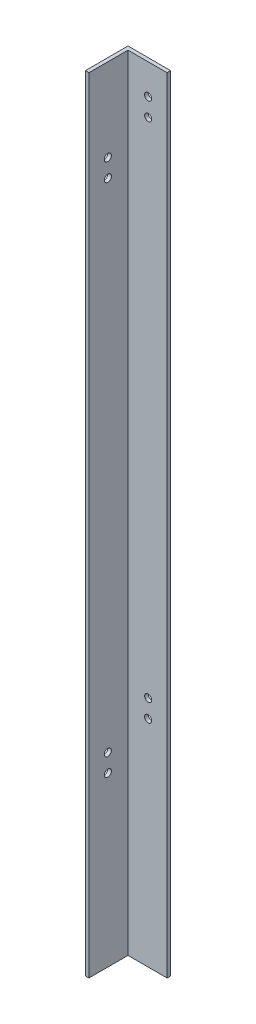
ISO-10303-21;
HEADER;
FILE_DESCRIPTION(('STEP AP214'),'2;1');
FILE_NAME('part.step','',(''),(''),'','','');
FILE_SCHEMA(('AUTOMOTIVE_DESIGN { 1 0 10303 214 1 1 1 1 }'));
ENDSEC;
DATA;
#1=APPLICATION_CONTEXT('core data for automotive mechanical design processes');
#2=APPLICATION_PROTOCOL_DEFINITION('international standard','automotive_design',2000,#1);
#3=PRODUCT_CONTEXT('',#1,'mechanical');
#4=PRODUCT('Part','Part','',(#3));
#5=PRODUCT_RELATED_PRODUCT_CATEGORY('part','',(#4));
#6=PRODUCT_DEFINITION_FORMATION('','',#4);
#7=PRODUCT_DEFINITION_CONTEXT('part definition',#1,'design');
#8=PRODUCT_DEFINITION('design','',#6,#7);
#9=PRODUCT_DEFINITION_SHAPE('','',#8);
#10=(LENGTH_UNIT() NAMED_UNIT(*) SI_UNIT(.MILLI.,.METRE.));
#11=(NAMED_UNIT(*) PLANE_ANGLE_UNIT() SI_UNIT($,.RADIAN.));
#12=(NAMED_UNIT(*) SI_UNIT($,.STERADIAN.) SOLID_ANGLE_UNIT());
#13=UNCERTAINTY_MEASURE_WITH_UNIT(LENGTH_MEASURE(1.E-05),#10,'distance_accuracy_value','');
#14=(GEOMETRIC_REPRESENTATION_CONTEXT(3) GLOBAL_UNCERTAINTY_ASSIGNED_CONTEXT((#13)) GLOBAL_UNIT_ASSIGNED_CONTEXT((#10,
#11,#12)) REPRESENTATION_CONTEXT('',''));
#15=CARTESIAN_POINT('',(0.,0.,0.));
#16=DIRECTION('',(0.,0.,1.));
#17=DIRECTION('',(1.,0.,0.));
#18=AXIS2_PLACEMENT_3D('',#15,#16,#17);
#19=CARTESIAN_POINT('',(-38.0999999999999,0.,3.2));
#20=DIRECTION('',(0.,1.,0.));
#21=DIRECTION('',(0.,0.,1.));
#22=AXIS2_PLACEMENT_3D('',#19,#20,#21);
#23=PLANE('',#22);
#24=DIRECTION('',(1.,0.,0.));
#25=VECTOR('',#24,1.);
#26=CARTESIAN_POINT('',(-38.0999999999999,0.,0.));
#27=LINE('',#26,#25);
#28=CARTESIAN_POINT('',(-38.0999999999999,0.,0.));
#29=VERTEX_POINT('',#28);
#30=CARTESIAN_POINT('',(0.,0.,0.));
#31=VERTEX_POINT('',#30);
#32=EDGE_CURVE('E97',#29,#31,#27,.T.);
#33=ORIENTED_EDGE('',*,*,#32,.T.);
#34=DIRECTION('',(0.,0.,-1.));
#35=VECTOR('',#34,1.);
#36=CARTESIAN_POINT('',(0.,0.,3.2));
#37=LINE('',#36,#35);
#38=CARTESIAN_POINT('',(0.,0.,3.2));
#39=VERTEX_POINT('',#38);
#40=EDGE_CURVE('E11',#39,#31,#37,.T.);
#41=ORIENTED_EDGE('',*,*,#40,.F.);
#42=DIRECTION('',(1.,0.,0.));
#43=VECTOR('',#42,1.);
#44=CARTESIAN_POINT('',(-38.0999999999999,0.,3.2));
#45=LINE('',#44,#43);
#46=CARTESIAN_POINT('',(-34.9,0.,3.2));
#47=VERTEX_POINT('',#46);
#48=EDGE_CURVE('E91',#47,#39,#45,.T.);
#49=ORIENTED_EDGE('',*,*,#48,.F.);
#50=DIRECTION('',(0.,0.,-1.));
#51=VECTOR('',#50,1.);
#52=CARTESIAN_POINT('',(-34.8999999999999,0.,38.1));
#53=LINE('',#52,#51);
#54=CARTESIAN_POINT('',(-34.8999999999999,0.,38.1));
#55=VERTEX_POINT('',#54);
#56=EDGE_CURVE('E106',#55,#47,#53,.T.);
#57=ORIENTED_EDGE('',*,*,#56,.F.);
#58=DIRECTION('',(1.,0.,0.));
#59=VECTOR('',#58,1.);
#60=CARTESIAN_POINT('',(-38.0999999999999,0.,38.1));
#61=LINE('',#60,#59);
#62=CARTESIAN_POINT('',(-38.0999999999999,0.,38.1));
#63=VERTEX_POINT('',#62);
#64=EDGE_CURVE('E100',#63,#55,#61,.T.);
#65=ORIENTED_EDGE('',*,*,#64,.F.);
#66=DIRECTION('',(0.,0.,-1.));
#67=VECTOR('',#66,1.);
#68=CARTESIAN_POINT('',(-38.0999999999999,0.,3.2));
#69=LINE('',#68,#67);
#70=EDGE_CURVE('E84',#63,#29,#69,.T.);
#71=ORIENTED_EDGE('',*,*,#70,.T.);
#72=EDGE_LOOP('',(#33,#41,#49,#57,#65,#71));
#73=FACE_BOUND('',#72,.T.);
#74=ADVANCED_FACE('F37',(#73),#23,.F.);
#75=CARTESIAN_POINT('',(0.,0.,3.2));
#76=DIRECTION('',(-1.,0.,0.));
#77=DIRECTION('',(0.,0.,1.));
#78=AXIS2_PLACEMENT_3D('',#75,#76,#77);
#79=PLANE('',#78);
#80=DIRECTION('',(0.,1.,0.));
#81=VECTOR('',#80,1.);
#82=CARTESIAN_POINT('',(0.,0.,0.));
#83=LINE('',#82,#81);
#84=CARTESIAN_POINT('',(0.,700.,0.));
#85=VERTEX_POINT('',#84);
#86=EDGE_CURVE('E105',#31,#85,#83,.T.);
#87=ORIENTED_EDGE('',*,*,#86,.T.);
#88=DIRECTION('',(0.,0.,-1.));
#89=VECTOR('',#88,1.);
#90=CARTESIAN_POINT('',(0.,700.,3.2));
#91=LINE('',#90,#89);
#92=CARTESIAN_POINT('',(0.,700.,3.2));
#93=VERTEX_POINT('',#92);
#94=EDGE_CURVE('E45',#93,#85,#91,.T.);
#95=ORIENTED_EDGE('',*,*,#94,.F.);
#96=DIRECTION('',(0.,1.,0.));
#97=VECTOR('',#96,1.);
#98=CARTESIAN_POINT('',(0.,0.,3.2));
#99=LINE('',#98,#97);
#100=EDGE_CURVE('E59',#39,#93,#99,.T.);
#101=ORIENTED_EDGE('',*,*,#100,.F.);
#102=ORIENTED_EDGE('',*,*,#40,.T.);
#103=EDGE_LOOP('',(#87,#95,#101,#102));
#104=FACE_BOUND('',#103,.T.);
#105=ADVANCED_FACE('F164',(#104),#79,.F.);
#106=CARTESIAN_POINT('',(-38.1,700.,3.2));
#107=DIRECTION('',(0.,-1.,0.));
#108=DIRECTION('',(0.,0.,-1.));
#109=AXIS2_PLACEMENT_3D('',#106,#107,#108);
#110=PLANE('',#109);
#111=DIRECTION('',(-1.,0.,0.));
#112=VECTOR('',#111,1.);
#113=CARTESIAN_POINT('',(-38.1,700.,0.));
#114=LINE('',#113,#112);
#115=CARTESIAN_POINT('',(-38.1,700.,0.));
#116=VERTEX_POINT('',#115);
#117=EDGE_CURVE('E92',#85,#116,#114,.T.);
#118=ORIENTED_EDGE('',*,*,#117,.T.);
#119=DIRECTION('',(0.,0.,-1.));
#120=VECTOR('',#119,1.);
#121=CARTESIAN_POINT('',(-38.1,700.,3.2));
#122=LINE('',#121,#120);
#123=CARTESIAN_POINT('',(-38.1,700.,38.1));
#124=VERTEX_POINT('',#123);
#125=EDGE_CURVE('E87',#124,#116,#122,.T.);
#126=ORIENTED_EDGE('',*,*,#125,.F.);
#127=DIRECTION('',(-1.,0.,0.));
#128=VECTOR('',#127,1.);
#129=CARTESIAN_POINT('',(-38.1,700.,38.1));
#130=LINE('',#129,#128);
#131=CARTESIAN_POINT('',(-34.9,700.,38.1));
#132=VERTEX_POINT('',#131);
#133=EDGE_CURVE('E141',#132,#124,#130,.T.);
#134=ORIENTED_EDGE('',*,*,#133,.F.);
#135=DIRECTION('',(0.,0.,-1.));
#136=VECTOR('',#135,1.);
#137=CARTESIAN_POINT('',(-34.9,700.,38.1));
#138=LINE('',#137,#136);
#139=CARTESIAN_POINT('',(-34.9,700.,3.2));
#140=VERTEX_POINT('',#139);
#141=EDGE_CURVE('E110',#132,#140,#138,.T.);
#142=ORIENTED_EDGE('',*,*,#141,.T.);
#143=DIRECTION('',(-1.,0.,0.));
#144=VECTOR('',#143,1.);
#145=CARTESIAN_POINT('',(-38.1,700.,3.2));
#146=LINE('',#145,#144);
#147=EDGE_CURVE('E102',#93,#140,#146,.T.);
#148=ORIENTED_EDGE('',*,*,#147,.F.);
#149=ORIENTED_EDGE('',*,*,#94,.T.);
#150=EDGE_LOOP('',(#118,#126,#134,#142,#148,#149));
#151=FACE_BOUND('',#150,.T.);
#152=ADVANCED_FACE('F147',(#151),#110,.F.);
#153=CARTESIAN_POINT('',(-38.1,700.,3.2));
#154=DIRECTION('',(1.,0.,0.));
#155=DIRECTION('',(0.,1.,0.));
#156=AXIS2_PLACEMENT_3D('',#153,#154,#155);
#157=PLANE('',#156);
#158=CARTESIAN_POINT('',(-38.1,626.,21.2));
#159=DIRECTION('',(1.,0.,0.));
#160=DIRECTION('',(0.,1.,0.));
#161=AXIS2_PLACEMENT_3D('',#158,#159,#160);
#162=CIRCLE('',#161,3.175);
#163=CARTESIAN_POINT('',(-38.1,629.175,21.2));
#164=VERTEX_POINT('',#163);
#165=EDGE_CURVE('E230',#164,#164,#162,.T.);
#166=ORIENTED_EDGE('',*,*,#165,.T.);
#167=EDGE_LOOP('',(#166));
#168=FACE_BOUND('',#167,.T.);
#169=CARTESIAN_POINT('',(-38.0999999999999,150.,21.2));
#170=DIRECTION('',(1.,0.,0.));
#171=DIRECTION('',(0.,1.,0.));
#172=AXIS2_PLACEMENT_3D('',#169,#170,#171);
#173=CIRCLE('',#172,3.175);
#174=CARTESIAN_POINT('',(-38.0999999999999,153.175,21.2));
#175=VERTEX_POINT('',#174);
#176=EDGE_CURVE('E226',#175,#175,#173,.T.);
#177=ORIENTED_EDGE('',*,*,#176,.T.);
#178=EDGE_LOOP('',(#177));
#179=FACE_BOUND('',#178,.T.);
#180=CARTESIAN_POINT('',(-38.0999999999999,166.,21.2));
#181=DIRECTION('',(1.,0.,0.));
#182=DIRECTION('',(0.,1.,0.));
#183=AXIS2_PLACEMENT_3D('',#180,#181,#182);
#184=CIRCLE('',#183,3.175);
#185=CARTESIAN_POINT('',(-38.0999999999999,169.175,21.2));
#186=VERTEX_POINT('',#185);
#187=EDGE_CURVE('E224',#186,#186,#184,.T.);
#188=ORIENTED_EDGE('',*,*,#187,.T.);
#189=EDGE_LOOP('',(#188));
#190=FACE_BOUND('',#189,.T.);
#191=CARTESIAN_POINT('',(-38.1,610.,21.2));
#192=DIRECTION('',(1.,0.,0.));
#193=DIRECTION('',(0.,1.,0.));
#194=AXIS2_PLACEMENT_3D('',#191,#192,#193);
#195=CIRCLE('',#194,3.175);
#196=CARTESIAN_POINT('',(-38.1,613.175,21.2));
#197=VERTEX_POINT('',#196);
#198=EDGE_CURVE('E227',#197,#197,#195,.T.);
#199=ORIENTED_EDGE('',*,*,#198,.T.);
#200=EDGE_LOOP('',(#199));
#201=FACE_BOUND('',#200,.T.);
#202=DIRECTION('',(0.,-1.,0.));
#203=VECTOR('',#202,1.);
#204=CARTESIAN_POINT('',(-38.1,700.,0.));
#205=LINE('',#204,#203);
#206=EDGE_CURVE('E79',#116,#29,#205,.T.);
#207=ORIENTED_EDGE('',*,*,#206,.T.);
#208=ORIENTED_EDGE('',*,*,#70,.F.);
#209=DIRECTION('',(0.,-1.,0.));
#210=VECTOR('',#209,1.);
#211=CARTESIAN_POINT('',(-38.1,700.,38.1));
#212=LINE('',#211,#210);
#213=EDGE_CURVE('E132',#124,#63,#212,.T.);
#214=ORIENTED_EDGE('',*,*,#213,.F.);
#215=ORIENTED_EDGE('',*,*,#125,.T.);
#216=EDGE_LOOP('',(#207,#208,#214,#215));
#217=FACE_BOUND('',#216,.T.);
#218=ADVANCED_FACE('F81',(#168,#179,#190,#201,#217),#157,.F.);
#219=CARTESIAN_POINT('',(0.,0.,3.2));
#220=DIRECTION('',(0.,0.,1.));
#221=DIRECTION('',(1.,0.,0.));
#222=AXIS2_PLACEMENT_3D('',#219,#220,#221);
#223=PLANE('',#222);
#224=CARTESIAN_POINT('',(-16.9,673.,3.2));
#225=DIRECTION('',(0.,0.,1.));
#226=DIRECTION('',(1.,0.,0.));
#227=AXIS2_PLACEMENT_3D('',#224,#225,#226);
#228=CIRCLE('',#227,3.175);
#229=CARTESIAN_POINT('',(-13.725,673.,3.2));
#230=VERTEX_POINT('',#229);
#231=EDGE_CURVE('E243',#230,#230,#228,.T.);
#232=ORIENTED_EDGE('',*,*,#231,.F.);
#233=EDGE_LOOP('',(#232));
#234=FACE_BOUND('',#233,.T.);
#235=CARTESIAN_POINT('',(-16.9,192.,3.2));
#236=DIRECTION('',(0.,0.,1.));
#237=DIRECTION('',(1.,0.,0.));
#238=AXIS2_PLACEMENT_3D('',#235,#236,#237);
#239=CIRCLE('',#238,3.175);
#240=CARTESIAN_POINT('',(-13.725,192.,3.2));
#241=VERTEX_POINT('',#240);
#242=EDGE_CURVE('E242',#241,#241,#239,.T.);
#243=ORIENTED_EDGE('',*,*,#242,.F.);
#244=EDGE_LOOP('',(#243));
#245=FACE_BOUND('',#244,.T.);
#246=CARTESIAN_POINT('',(-16.9,208.,3.2));
#247=DIRECTION('',(0.,0.,1.));
#248=DIRECTION('',(1.,0.,0.));
#249=AXIS2_PLACEMENT_3D('',#246,#247,#248);
#250=CIRCLE('',#249,3.175);
#251=CARTESIAN_POINT('',(-13.725,208.,3.2));
#252=VERTEX_POINT('',#251);
#253=EDGE_CURVE('E239',#252,#252,#250,.T.);
#254=ORIENTED_EDGE('',*,*,#253,.F.);
#255=EDGE_LOOP('',(#254));
#256=FACE_BOUND('',#255,.T.);
#257=CARTESIAN_POINT('',(-16.9,657.,3.2));
#258=DIRECTION('',(0.,0.,1.));
#259=DIRECTION('',(1.,0.,0.));
#260=AXIS2_PLACEMENT_3D('',#257,#258,#259);
#261=CIRCLE('',#260,3.175);
#262=CARTESIAN_POINT('',(-13.725,657.,3.2));
#263=VERTEX_POINT('',#262);
#264=EDGE_CURVE('E123',#263,#263,#261,.T.);
#265=ORIENTED_EDGE('',*,*,#264,.F.);
#266=EDGE_LOOP('',(#265));
#267=FACE_BOUND('',#266,.T.);
#268=DIRECTION('',(0.,1.,0.));
#269=VECTOR('',#268,1.);
#270=CARTESIAN_POINT('',(-34.9,700.,3.2));
#271=LINE('',#270,#269);
#272=EDGE_CURVE('E53',#47,#140,#271,.T.);
#273=ORIENTED_EDGE('',*,*,#272,.F.);
#274=ORIENTED_EDGE('',*,*,#48,.T.);
#275=ORIENTED_EDGE('',*,*,#100,.T.);
#276=ORIENTED_EDGE('',*,*,#147,.T.);
#277=EDGE_LOOP('',(#273,#274,#275,#276));
#278=FACE_BOUND('',#277,.T.);
#279=ADVANCED_FACE('F145',(#234,#245,#256,#267,#278),#223,.T.);
#280=CARTESIAN_POINT('',(0.,0.,0.));
#281=DIRECTION('',(0.,0.,1.));
#282=DIRECTION('',(1.,0.,0.));
#283=AXIS2_PLACEMENT_3D('',#280,#281,#282);
#284=PLANE('',#283);
#285=CARTESIAN_POINT('',(-16.9,673.,0.));
#286=DIRECTION('',(0.,0.,1.));
#287=DIRECTION('',(1.,0.,0.));
#288=AXIS2_PLACEMENT_3D('',#285,#286,#287);
#289=CIRCLE('',#288,3.175);
#290=CARTESIAN_POINT('',(-13.725,673.,0.));
#291=VERTEX_POINT('',#290);
#292=EDGE_CURVE('E40',#291,#291,#289,.T.);
#293=ORIENTED_EDGE('',*,*,#292,.T.);
#294=EDGE_LOOP('',(#293));
#295=FACE_BOUND('',#294,.T.);
#296=CARTESIAN_POINT('',(-16.9,192.,0.));
#297=DIRECTION('',(0.,0.,1.));
#298=DIRECTION('',(1.,0.,0.));
#299=AXIS2_PLACEMENT_3D('',#296,#297,#298);
#300=CIRCLE('',#299,3.175);
#301=CARTESIAN_POINT('',(-13.725,192.,0.));
#302=VERTEX_POINT('',#301);
#303=EDGE_CURVE('E125',#302,#302,#300,.T.);
#304=ORIENTED_EDGE('',*,*,#303,.T.);
#305=EDGE_LOOP('',(#304));
#306=FACE_BOUND('',#305,.T.);
#307=CARTESIAN_POINT('',(-16.9,208.,0.));
#308=DIRECTION('',(0.,0.,1.));
#309=DIRECTION('',(1.,0.,0.));
#310=AXIS2_PLACEMENT_3D('',#307,#308,#309);
#311=CIRCLE('',#310,3.175);
#312=CARTESIAN_POINT('',(-13.725,208.,0.));
#313=VERTEX_POINT('',#312);
#314=EDGE_CURVE('E122',#313,#313,#311,.T.);
#315=ORIENTED_EDGE('',*,*,#314,.T.);
#316=EDGE_LOOP('',(#315));
#317=FACE_BOUND('',#316,.T.);
#318=CARTESIAN_POINT('',(-16.9,657.,0.));
#319=DIRECTION('',(0.,0.,1.));
#320=DIRECTION('',(1.,0.,0.));
#321=AXIS2_PLACEMENT_3D('',#318,#319,#320);
#322=CIRCLE('',#321,3.175);
#323=CARTESIAN_POINT('',(-13.725,657.,0.));
#324=VERTEX_POINT('',#323);
#325=EDGE_CURVE('E119',#324,#324,#322,.T.);
#326=ORIENTED_EDGE('',*,*,#325,.T.);
#327=EDGE_LOOP('',(#326));
#328=FACE_BOUND('',#327,.T.);
#329=ORIENTED_EDGE('',*,*,#32,.F.);
#330=ORIENTED_EDGE('',*,*,#206,.F.);
#331=ORIENTED_EDGE('',*,*,#117,.F.);
#332=ORIENTED_EDGE('',*,*,#86,.F.);
#333=EDGE_LOOP('',(#329,#330,#331,#332));
#334=FACE_BOUND('',#333,.T.);
#335=ADVANCED_FACE('F104',(#295,#306,#317,#328,#334),#284,.F.);
#336=CARTESIAN_POINT('',(-34.9,700.,38.1));
#337=DIRECTION('',(-1.,0.,0.));
#338=DIRECTION('',(0.,-1.,0.));
#339=AXIS2_PLACEMENT_3D('',#336,#337,#338);
#340=PLANE('',#339);
#341=CARTESIAN_POINT('',(-34.9,626.,21.2));
#342=DIRECTION('',(1.,0.,0.));
#343=DIRECTION('',(0.,1.,0.));
#344=AXIS2_PLACEMENT_3D('',#341,#342,#343);
#345=CIRCLE('',#344,3.175);
#346=CARTESIAN_POINT('',(-34.9,629.175,21.2));
#347=VERTEX_POINT('',#346);
#348=EDGE_CURVE('E274',#347,#347,#345,.T.);
#349=ORIENTED_EDGE('',*,*,#348,.F.);
#350=EDGE_LOOP('',(#349));
#351=FACE_BOUND('',#350,.T.);
#352=CARTESIAN_POINT('',(-34.8999999999999,150.,21.2));
#353=DIRECTION('',(1.,0.,0.));
#354=DIRECTION('',(0.,1.,0.));
#355=AXIS2_PLACEMENT_3D('',#352,#353,#354);
#356=CIRCLE('',#355,3.175);
#357=CARTESIAN_POINT('',(-34.8999999999999,153.175,21.2));
#358=VERTEX_POINT('',#357);
#359=EDGE_CURVE('E275',#358,#358,#356,.T.);
#360=ORIENTED_EDGE('',*,*,#359,.F.);
#361=EDGE_LOOP('',(#360));
#362=FACE_BOUND('',#361,.T.);
#363=CARTESIAN_POINT('',(-34.8999999999999,166.,21.2));
#364=DIRECTION('',(1.,0.,0.));
#365=DIRECTION('',(0.,1.,0.));
#366=AXIS2_PLACEMENT_3D('',#363,#364,#365);
#367=CIRCLE('',#366,3.175);
#368=CARTESIAN_POINT('',(-34.8999999999999,169.175,21.2));
#369=VERTEX_POINT('',#368);
#370=EDGE_CURVE('E221',#369,#369,#367,.T.);
#371=ORIENTED_EDGE('',*,*,#370,.F.);
#372=EDGE_LOOP('',(#371));
#373=FACE_BOUND('',#372,.T.);
#374=CARTESIAN_POINT('',(-34.9,610.,21.2));
#375=DIRECTION('',(1.,0.,0.));
#376=DIRECTION('',(0.,1.,0.));
#377=AXIS2_PLACEMENT_3D('',#374,#375,#376);
#378=CIRCLE('',#377,3.175);
#379=CARTESIAN_POINT('',(-34.9,613.175,21.2));
#380=VERTEX_POINT('',#379);
#381=EDGE_CURVE('E233',#380,#380,#378,.T.);
#382=ORIENTED_EDGE('',*,*,#381,.F.);
#383=EDGE_LOOP('',(#382));
#384=FACE_BOUND('',#383,.T.);
#385=ORIENTED_EDGE('',*,*,#272,.T.);
#386=ORIENTED_EDGE('',*,*,#141,.F.);
#387=DIRECTION('',(0.,1.,0.));
#388=VECTOR('',#387,1.);
#389=CARTESIAN_POINT('',(-34.9,700.,38.1));
#390=LINE('',#389,#388);
#391=EDGE_CURVE('E155',#55,#132,#390,.T.);
#392=ORIENTED_EDGE('',*,*,#391,.F.);
#393=ORIENTED_EDGE('',*,*,#56,.T.);
#394=EDGE_LOOP('',(#385,#386,#392,#393));
#395=FACE_BOUND('',#394,.T.);
#396=ADVANCED_FACE('F152',(#351,#362,#373,#384,#395),#340,.F.);
#397=CARTESIAN_POINT('',(0.,0.,38.1));
#398=DIRECTION('',(0.,0.,1.));
#399=DIRECTION('',(1.,0.,0.));
#400=AXIS2_PLACEMENT_3D('',#397,#398,#399);
#401=PLANE('',#400);
#402=ORIENTED_EDGE('',*,*,#213,.T.);
#403=ORIENTED_EDGE('',*,*,#64,.T.);
#404=ORIENTED_EDGE('',*,*,#391,.T.);
#405=ORIENTED_EDGE('',*,*,#133,.T.);
#406=EDGE_LOOP('',(#402,#403,#404,#405));
#407=FACE_BOUND('',#406,.T.);
#408=ADVANCED_FACE('F161',(#407),#401,.T.);
#409=CARTESIAN_POINT('',(-16.9,657.,-6.8));
#410=DIRECTION('',(0.,0.,1.));
#411=DIRECTION('',(1.,0.,0.));
#412=AXIS2_PLACEMENT_3D('',#409,#410,#411);
#413=CYLINDRICAL_SURFACE('',#412,3.175);
#414=ORIENTED_EDGE('',*,*,#264,.T.);
#415=EDGE_LOOP('',(#414));
#416=FACE_BOUND('',#415,.T.);
#417=ORIENTED_EDGE('',*,*,#325,.F.);
#418=EDGE_LOOP('',(#417));
#419=FACE_BOUND('',#418,.T.);
#420=ADVANCED_FACE('F185',(#416,#419),#413,.F.);
#421=CARTESIAN_POINT('',(-16.9,208.,-6.8));
#422=DIRECTION('',(0.,0.,1.));
#423=DIRECTION('',(1.,0.,0.));
#424=AXIS2_PLACEMENT_3D('',#421,#422,#423);
#425=CYLINDRICAL_SURFACE('',#424,3.175);
#426=ORIENTED_EDGE('',*,*,#253,.T.);
#427=EDGE_LOOP('',(#426));
#428=FACE_BOUND('',#427,.T.);
#429=ORIENTED_EDGE('',*,*,#314,.F.);
#430=EDGE_LOOP('',(#429));
#431=FACE_BOUND('',#430,.T.);
#432=ADVANCED_FACE('F188',(#428,#431),#425,.F.);
#433=CARTESIAN_POINT('',(-16.9,192.,-6.8));
#434=DIRECTION('',(0.,0.,1.));
#435=DIRECTION('',(1.,0.,0.));
#436=AXIS2_PLACEMENT_3D('',#433,#434,#435);
#437=CYLINDRICAL_SURFACE('',#436,3.175);
#438=ORIENTED_EDGE('',*,*,#242,.T.);
#439=EDGE_LOOP('',(#438));
#440=FACE_BOUND('',#439,.T.);
#441=ORIENTED_EDGE('',*,*,#303,.F.);
#442=EDGE_LOOP('',(#441));
#443=FACE_BOUND('',#442,.T.);
#444=ADVANCED_FACE('F190',(#440,#443),#437,.F.);
#445=CARTESIAN_POINT('',(-16.9,673.,-6.8));
#446=DIRECTION('',(0.,0.,1.));
#447=DIRECTION('',(1.,0.,0.));
#448=AXIS2_PLACEMENT_3D('',#445,#446,#447);
#449=CYLINDRICAL_SURFACE('',#448,3.175);
#450=ORIENTED_EDGE('',*,*,#231,.T.);
#451=EDGE_LOOP('',(#450));
#452=FACE_BOUND('',#451,.T.);
#453=ORIENTED_EDGE('',*,*,#292,.F.);
#454=EDGE_LOOP('',(#453));
#455=FACE_BOUND('',#454,.T.);
#456=ADVANCED_FACE('F193',(#452,#455),#449,.F.);
#457=CARTESIAN_POINT('',(-44.9,610.,21.2));
#458=DIRECTION('',(1.,0.,0.));
#459=DIRECTION('',(0.,1.,0.));
#460=AXIS2_PLACEMENT_3D('',#457,#458,#459);
#461=CYLINDRICAL_SURFACE('',#460,3.175);
#462=ORIENTED_EDGE('',*,*,#381,.T.);
#463=EDGE_LOOP('',(#462));
#464=FACE_BOUND('',#463,.T.);
#465=ORIENTED_EDGE('',*,*,#198,.F.);
#466=EDGE_LOOP('',(#465));
#467=FACE_BOUND('',#466,.T.);
#468=ADVANCED_FACE('F197',(#464,#467),#461,.F.);
#469=CARTESIAN_POINT('',(-44.8999999999999,166.,21.2));
#470=DIRECTION('',(1.,0.,0.));
#471=DIRECTION('',(0.,1.,0.));
#472=AXIS2_PLACEMENT_3D('',#469,#470,#471);
#473=CYLINDRICAL_SURFACE('',#472,3.175);
#474=ORIENTED_EDGE('',*,*,#370,.T.);
#475=EDGE_LOOP('',(#474));
#476=FACE_BOUND('',#475,.T.);
#477=ORIENTED_EDGE('',*,*,#187,.F.);
#478=EDGE_LOOP('',(#477));
#479=FACE_BOUND('',#478,.T.);
#480=ADVANCED_FACE('F204',(#476,#479),#473,.F.);
#481=CARTESIAN_POINT('',(-44.8999999999999,150.,21.2));
#482=DIRECTION('',(1.,0.,0.));
#483=DIRECTION('',(0.,1.,0.));
#484=AXIS2_PLACEMENT_3D('',#481,#482,#483);
#485=CYLINDRICAL_SURFACE('',#484,3.175);
#486=ORIENTED_EDGE('',*,*,#359,.T.);
#487=EDGE_LOOP('',(#486));
#488=FACE_BOUND('',#487,.T.);
#489=ORIENTED_EDGE('',*,*,#176,.F.);
#490=EDGE_LOOP('',(#489));
#491=FACE_BOUND('',#490,.T.);
#492=ADVANCED_FACE('F206',(#488,#491),#485,.F.);
#493=CARTESIAN_POINT('',(-44.9,626.,21.2));
#494=DIRECTION('',(1.,0.,0.));
#495=DIRECTION('',(0.,1.,0.));
#496=AXIS2_PLACEMENT_3D('',#493,#494,#495);
#497=CYLINDRICAL_SURFACE('',#496,3.175);
#498=ORIENTED_EDGE('',*,*,#348,.T.);
#499=EDGE_LOOP('',(#498));
#500=FACE_BOUND('',#499,.T.);
#501=ORIENTED_EDGE('',*,*,#165,.F.);
#502=EDGE_LOOP('',(#501));
#503=FACE_BOUND('',#502,.T.);
#504=ADVANCED_FACE('F209',(#500,#503),#497,.F.);
#505=CLOSED_SHELL('',(#74,#105,#152,#218,#279,#335,#396,#408,#420,#432,#444,#456,#468,#480,#492,#504));
#506=MANIFOLD_SOLID_BREP('B2',#505);
#507=ADVANCED_BREP_SHAPE_REPRESENTATION('',(#18,#506),#14);
#508=SHAPE_DEFINITION_REPRESENTATION(#9,#507);
ENDSEC;
END-ISO-10303-21;
